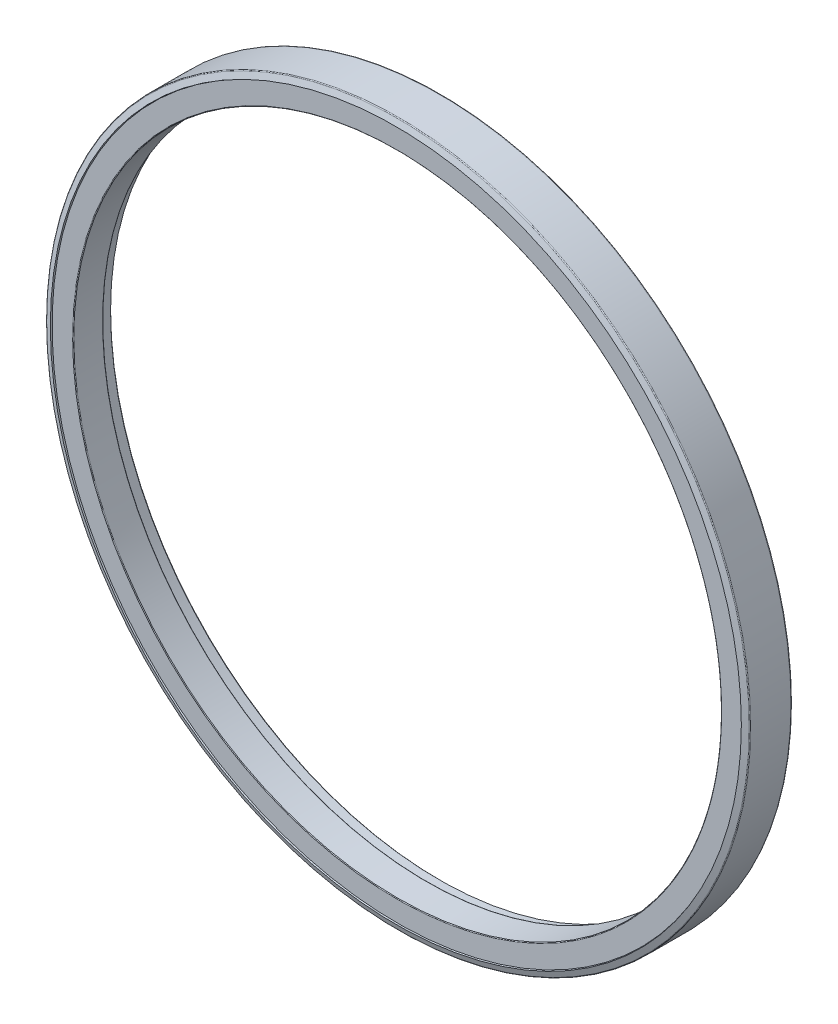
ISO-10303-21;
HEADER;
FILE_DESCRIPTION(('STEP AP214'),'2;1');
FILE_NAME('part.step','',(''),(''),'','','');
FILE_SCHEMA(('AUTOMOTIVE_DESIGN { 1 0 10303 214 1 1 1 1 }'));
ENDSEC;
DATA;
#1=APPLICATION_CONTEXT('core data for automotive mechanical design processes');
#2=APPLICATION_PROTOCOL_DEFINITION('international standard','automotive_design',2000,#1);
#3=PRODUCT_CONTEXT('',#1,'mechanical');
#4=PRODUCT('Part','Part','',(#3));
#5=PRODUCT_RELATED_PRODUCT_CATEGORY('part','',(#4));
#6=PRODUCT_DEFINITION_FORMATION('','',#4);
#7=PRODUCT_DEFINITION_CONTEXT('part definition',#1,'design');
#8=PRODUCT_DEFINITION('design','',#6,#7);
#9=PRODUCT_DEFINITION_SHAPE('','',#8);
#10=(LENGTH_UNIT() NAMED_UNIT(*) SI_UNIT(.MILLI.,.METRE.));
#11=(NAMED_UNIT(*) PLANE_ANGLE_UNIT() SI_UNIT($,.RADIAN.));
#12=(NAMED_UNIT(*) SI_UNIT($,.STERADIAN.) SOLID_ANGLE_UNIT());
#13=UNCERTAINTY_MEASURE_WITH_UNIT(LENGTH_MEASURE(1.E-05),#10,'distance_accuracy_value','');
#14=(GEOMETRIC_REPRESENTATION_CONTEXT(3) GLOBAL_UNCERTAINTY_ASSIGNED_CONTEXT((#13)) GLOBAL_UNIT_ASSIGNED_CONTEXT((#10,
#11,#12)) REPRESENTATION_CONTEXT('',''));
#15=CARTESIAN_POINT('',(0.,0.,0.));
#16=DIRECTION('',(0.,0.,1.));
#17=DIRECTION('',(1.,0.,0.));
#18=AXIS2_PLACEMENT_3D('',#15,#16,#17);
#19=CARTESIAN_POINT('',(0.,0.,-3.4163));
#20=DIRECTION('',(0.,0.,1.));
#21=DIRECTION('',(1.,0.,0.));
#22=AXIS2_PLACEMENT_3D('',#19,#20,#21);
#23=PLANE('',#22);
#24=CARTESIAN_POINT('',(0.,0.,-3.4163));
#25=DIRECTION('',(0.,0.,1.));
#26=DIRECTION('',(0.,1.,0.));
#27=AXIS2_PLACEMENT_3D('',#24,#25,#26);
#28=CIRCLE('',#27,127.254);
#29=CARTESIAN_POINT('',(0.,127.254,-3.4163));
#30=VERTEX_POINT('',#29);
#31=EDGE_CURVE('E143',#30,#30,#28,.F.);
#32=ORIENTED_EDGE('',*,*,#31,.T.);
#33=EDGE_LOOP('',(#32));
#34=FACE_BOUND('',#33,.T.);
#35=CARTESIAN_POINT('',(0.,0.,-3.4163));
#36=DIRECTION('',(0.,0.,-1.));
#37=DIRECTION('',(1.,0.,0.));
#38=AXIS2_PLACEMENT_3D('',#35,#36,#37);
#39=CIRCLE('',#38,125.6792);
#40=CARTESIAN_POINT('',(125.6792,0.,-3.4163));
#41=VERTEX_POINT('',#40);
#42=EDGE_CURVE('E174',#41,#41,#39,.T.);
#43=ORIENTED_EDGE('',*,*,#42,.F.);
#44=EDGE_LOOP('',(#43));
#45=FACE_BOUND('',#44,.T.);
#46=ADVANCED_FACE('F15',(#34,#45),#23,.F.);
#47=CARTESIAN_POINT('',(0.,0.,-3.2131));
#48=DIRECTION('',(0.,0.,1.));
#49=DIRECTION('',(1.,0.,0.));
#50=AXIS2_PLACEMENT_3D('',#47,#48,#49);
#51=TOROIDAL_SURFACE('',#50,125.6792,0.2032);
#52=CARTESIAN_POINT('',(0.,0.,-3.2131));
#53=DIRECTION('',(0.,0.,1.));
#54=DIRECTION('',(1.,0.,0.));
#55=AXIS2_PLACEMENT_3D('',#52,#53,#54);
#56=CIRCLE('',#55,125.476);
#57=CARTESIAN_POINT('',(125.476,0.,-3.2131));
#58=VERTEX_POINT('',#57);
#59=EDGE_CURVE('E138',#58,#58,#56,.T.);
#60=ORIENTED_EDGE('',*,*,#59,.T.);
#61=EDGE_LOOP('',(#60));
#62=FACE_BOUND('',#61,.T.);
#63=ORIENTED_EDGE('',*,*,#42,.T.);
#64=EDGE_LOOP('',(#63));
#65=FACE_BOUND('',#64,.T.);
#66=ADVANCED_FACE('F155',(#62,#65),#51,.T.);
#67=CARTESIAN_POINT('',(0.,0.,-3.7973));
#68=DIRECTION('',(0.,0.,1.));
#69=DIRECTION('',(1.,0.,0.));
#70=AXIS2_PLACEMENT_3D('',#67,#68,#69);
#71=TOROIDAL_SURFACE('',#70,127.254,0.381);
#72=CARTESIAN_POINT('',(0.,0.,-3.99919923967265));
#73=DIRECTION('',(0.,0.,1.));
#74=DIRECTION('',(1.,0.,0.));
#75=AXIS2_PLACEMENT_3D('',#72,#73,#74);
#76=CIRCLE('',#75,127.577106324636);
#77=CARTESIAN_POINT('',(127.577106324636,0.,-3.99919923967265));
#78=VERTEX_POINT('',#77);
#79=EDGE_CURVE('E130',#78,#78,#76,.F.);
#80=ORIENTED_EDGE('',*,*,#79,.T.);
#81=EDGE_LOOP('',(#80));
#82=FACE_BOUND('',#81,.T.);
#83=ORIENTED_EDGE('',*,*,#31,.F.);
#84=EDGE_LOOP('',(#83));
#85=FACE_BOUND('',#84,.T.);
#86=ADVANCED_FACE('F151',(#82,#85),#71,.F.);
#87=CARTESIAN_POINT('',(0.,0.,8.6233));
#88=DIRECTION('',(0.,0.,1.));
#89=DIRECTION('',(1.,0.,0.));
#90=AXIS2_PLACEMENT_3D('',#87,#88,#89);
#91=CYLINDRICAL_SURFACE('',#90,125.476);
#92=CARTESIAN_POINT('',(0.,0.,7.86129999999994));
#93=DIRECTION('',(0.,0.,-1.));
#94=DIRECTION('',(-1.,0.,0.));
#95=AXIS2_PLACEMENT_3D('',#92,#93,#94);
#96=CIRCLE('',#95,125.476);
#97=CARTESIAN_POINT('',(-125.476,0.,7.86129999999994));
#98=VERTEX_POINT('',#97);
#99=EDGE_CURVE('E111',#98,#98,#96,.T.);
#100=ORIENTED_EDGE('',*,*,#99,.F.);
#101=EDGE_LOOP('',(#100));
#102=FACE_BOUND('',#101,.T.);
#103=ORIENTED_EDGE('',*,*,#59,.F.);
#104=EDGE_LOOP('',(#103));
#105=FACE_BOUND('',#104,.T.);
#106=ADVANCED_FACE('F154',(#102,#105),#91,.F.);
#107=CARTESIAN_POINT('',(0.,0.,-3.99919923967265));
#108=DIRECTION('',(0.,0.,1.));
#109=DIRECTION('',(1.,0.,0.));
#110=AXIS2_PLACEMENT_3D('',#107,#108,#109);
#111=CONICAL_SURFACE('',#110,127.577106324636,0.558505360638183);
#112=CARTESIAN_POINT('',(0.,0.,-4.51627744753875));
#113=DIRECTION('',(0.,0.,-1.));
#114=DIRECTION('',(-1.,0.,0.));
#115=AXIS2_PLACEMENT_3D('',#112,#113,#114);
#116=CIRCLE('',#115,127.254);
#117=CARTESIAN_POINT('',(-127.254,0.,-4.51627744753875));
#118=VERTEX_POINT('',#117);
#119=EDGE_CURVE('E102',#118,#118,#116,.T.);
#120=ORIENTED_EDGE('',*,*,#119,.T.);
#121=EDGE_LOOP('',(#120));
#122=FACE_BOUND('',#121,.T.);
#123=ORIENTED_EDGE('',*,*,#79,.F.);
#124=EDGE_LOOP('',(#123));
#125=FACE_BOUND('',#124,.T.);
#126=ADVANCED_FACE('F121',(#122,#125),#111,.F.);
#127=CARTESIAN_POINT('',(0.,0.,7.86129999999994));
#128=DIRECTION('',(0.,0.,-1.));
#129=DIRECTION('',(-1.,0.,0.));
#130=AXIS2_PLACEMENT_3D('',#127,#128,#129);
#131=TOROIDAL_SURFACE('',#130,125.73,0.254);
#132=ORIENTED_EDGE('',*,*,#99,.T.);
#133=EDGE_LOOP('',(#132));
#134=FACE_BOUND('',#133,.T.);
#135=CARTESIAN_POINT('',(0.,0.,8.11529999999994));
#136=DIRECTION('',(0.,0.,1.));
#137=DIRECTION('',(-1.,0.,0.));
#138=AXIS2_PLACEMENT_3D('',#135,#136,#137);
#139=CIRCLE('',#138,125.73);
#140=CARTESIAN_POINT('',(-125.73,0.,8.11529999999994));
#141=VERTEX_POINT('',#140);
#142=EDGE_CURVE('E110',#141,#141,#139,.T.);
#143=ORIENTED_EDGE('',*,*,#142,.T.);
#144=EDGE_LOOP('',(#143));
#145=FACE_BOUND('',#144,.T.);
#146=ADVANCED_FACE('F117',(#134,#145),#131,.T.);
#147=CARTESIAN_POINT('',(0.,0.,-8.6233));
#148=DIRECTION('',(0.,0.,-1.));
#149=DIRECTION('',(-1.,0.,0.));
#150=AXIS2_PLACEMENT_3D('',#147,#148,#149);
#151=CYLINDRICAL_SURFACE('',#150,127.254);
#152=ORIENTED_EDGE('',*,*,#119,.F.);
#153=EDGE_LOOP('',(#152));
#154=FACE_BOUND('',#153,.T.);
#155=CARTESIAN_POINT('',(0.,0.,-8.11529999999999));
#156=DIRECTION('',(0.,0.,-1.));
#157=DIRECTION('',(-1.,0.,0.));
#158=AXIS2_PLACEMENT_3D('',#155,#156,#157);
#159=CIRCLE('',#158,127.254);
#160=CARTESIAN_POINT('',(-127.254,0.,-8.1153));
#161=VERTEX_POINT('',#160);
#162=EDGE_CURVE('E186',#161,#161,#159,.T.);
#163=ORIENTED_EDGE('',*,*,#162,.T.);
#164=EDGE_LOOP('',(#163));
#165=FACE_BOUND('',#164,.T.);
#166=ADVANCED_FACE('F92',(#154,#165),#151,.F.);
#167=CARTESIAN_POINT('',(0.,0.,8.11529999999994));
#168=DIRECTION('',(0.,0.,-1.));
#169=DIRECTION('',(-1.,0.,0.));
#170=AXIS2_PLACEMENT_3D('',#167,#168,#169);
#171=PLANE('',#170);
#172=CARTESIAN_POINT('',(0.,0.,8.11530000000002));
#173=DIRECTION('',(0.,0.,1.));
#174=DIRECTION('',(1.,0.,0.));
#175=AXIS2_PLACEMENT_3D('',#172,#173,#174);
#176=CIRCLE('',#175,133.673103120993);
#177=CARTESIAN_POINT('',(133.673103120993,0.,8.11530000000002));
#178=VERTEX_POINT('',#177);
#179=EDGE_CURVE('E19',#178,#178,#176,.T.);
#180=ORIENTED_EDGE('',*,*,#179,.T.);
#181=EDGE_LOOP('',(#180));
#182=FACE_BOUND('',#181,.T.);
#183=ORIENTED_EDGE('',*,*,#142,.F.);
#184=EDGE_LOOP('',(#183));
#185=FACE_BOUND('',#184,.T.);
#186=ADVANCED_FACE('F87',(#182,#185),#171,.F.);
#187=CARTESIAN_POINT('',(0.,0.,-8.6233));
#188=DIRECTION('',(0.,0.,-1.));
#189=DIRECTION('',(-1.,0.,0.));
#190=AXIS2_PLACEMENT_3D('',#187,#188,#189);
#191=CONICAL_SURFACE('',#190,127.762,0.785398163397453);
#192=CARTESIAN_POINT('',(0.,0.,-8.6233));
#193=DIRECTION('',(0.,0.,-1.));
#194=DIRECTION('',(-1.,0.,0.));
#195=AXIS2_PLACEMENT_3D('',#192,#193,#194);
#196=CIRCLE('',#195,127.762);
#197=CARTESIAN_POINT('',(-127.762,0.,-8.6233));
#198=VERTEX_POINT('',#197);
#199=EDGE_CURVE('E61',#198,#198,#196,.F.);
#200=ORIENTED_EDGE('',*,*,#199,.F.);
#201=EDGE_LOOP('',(#200));
#202=FACE_BOUND('',#201,.T.);
#203=ORIENTED_EDGE('',*,*,#162,.F.);
#204=EDGE_LOOP('',(#203));
#205=FACE_BOUND('',#204,.T.);
#206=ADVANCED_FACE('F83',(#202,#205),#191,.F.);
#207=CARTESIAN_POINT('',(0.,0.,8.62329999999999));
#208=DIRECTION('',(0.,0.,1.));
#209=DIRECTION('',(1.,0.,0.));
#210=AXIS2_PLACEMENT_3D('',#207,#208,#209);
#211=CONICAL_SURFACE('',#210,133.858,0.349065850398842);
#212=CARTESIAN_POINT('',(0.,0.,8.62330000000001));
#213=DIRECTION('',(0.,0.,-1.));
#214=DIRECTION('',(-1.,0.,0.));
#215=AXIS2_PLACEMENT_3D('',#212,#213,#214);
#216=CIRCLE('',#215,133.858);
#217=CARTESIAN_POINT('',(-133.858,0.,8.62330000000001));
#218=VERTEX_POINT('',#217);
#219=EDGE_CURVE('E57',#218,#218,#216,.T.);
#220=ORIENTED_EDGE('',*,*,#219,.F.);
#221=EDGE_LOOP('',(#220));
#222=FACE_BOUND('',#221,.T.);
#223=ORIENTED_EDGE('',*,*,#179,.F.);
#224=EDGE_LOOP('',(#223));
#225=FACE_BOUND('',#224,.T.);
#226=ADVANCED_FACE('F80',(#222,#225),#211,.F.);
#227=CARTESIAN_POINT('',(0.,0.,-8.6233));
#228=DIRECTION('',(0.,0.,-1.));
#229=DIRECTION('',(-1.,0.,0.));
#230=AXIS2_PLACEMENT_3D('',#227,#228,#229);
#231=PLANE('',#230);
#232=CARTESIAN_POINT('',(0.,0.,-8.6233));
#233=DIRECTION('',(0.,0.,1.));
#234=DIRECTION('',(-1.,0.,0.));
#235=AXIS2_PLACEMENT_3D('',#232,#233,#234);
#236=CIRCLE('',#235,135.8138);
#237=CARTESIAN_POINT('',(-135.8138,0.,-8.6233));
#238=VERTEX_POINT('',#237);
#239=EDGE_CURVE('E60',#238,#238,#236,.T.);
#240=ORIENTED_EDGE('',*,*,#239,.F.);
#241=EDGE_LOOP('',(#240));
#242=FACE_BOUND('',#241,.T.);
#243=ORIENTED_EDGE('',*,*,#199,.T.);
#244=EDGE_LOOP('',(#243));
#245=FACE_BOUND('',#244,.T.);
#246=ADVANCED_FACE('F71',(#242,#245),#231,.T.);
#247=CARTESIAN_POINT('',(0.,0.,7.8177939532765));
#248=DIRECTION('',(0.,0.,-1.));
#249=DIRECTION('',(0.,1.,0.));
#250=AXIS2_PLACEMENT_3D('',#247,#248,#249);
#251=CONICAL_SURFACE('',#250,136.071109674607,1.22173047639603);
#252=ORIENTED_EDGE('',*,*,#219,.T.);
#253=EDGE_LOOP('',(#252));
#254=FACE_BOUND('',#253,.T.);
#255=CARTESIAN_POINT('',(0.,0.,7.8177939532765));
#256=DIRECTION('',(0.,0.,-1.));
#257=DIRECTION('',(-1.,0.,0.));
#258=AXIS2_PLACEMENT_3D('',#255,#256,#257);
#259=CIRCLE('',#258,136.071109674607);
#260=CARTESIAN_POINT('',(-136.071109674607,0.,7.8177939532765));
#261=VERTEX_POINT('',#260);
#262=EDGE_CURVE('E28',#261,#261,#259,.T.);
#263=ORIENTED_EDGE('',*,*,#262,.F.);
#264=EDGE_LOOP('',(#263));
#265=FACE_BOUND('',#264,.T.);
#266=ADVANCED_FACE('F50',(#254,#265),#251,.T.);
#267=CARTESIAN_POINT('',(0.,0.,-8.1153));
#268=DIRECTION('',(0.,0.,-1.));
#269=DIRECTION('',(-1.,0.,0.));
#270=AXIS2_PLACEMENT_3D('',#267,#268,#269);
#271=TOROIDAL_SURFACE('',#270,135.8138,0.508);
#272=ORIENTED_EDGE('',*,*,#239,.T.);
#273=EDGE_LOOP('',(#272));
#274=FACE_BOUND('',#273,.T.);
#275=CARTESIAN_POINT('',(0.,0.,-8.1153));
#276=DIRECTION('',(0.,0.,1.));
#277=DIRECTION('',(1.,0.,0.));
#278=AXIS2_PLACEMENT_3D('',#275,#276,#277);
#279=CIRCLE('',#278,136.3218);
#280=CARTESIAN_POINT('',(136.3218,0.,-8.1153));
#281=VERTEX_POINT('',#280);
#282=EDGE_CURVE('E23',#281,#281,#279,.T.);
#283=ORIENTED_EDGE('',*,*,#282,.F.);
#284=EDGE_LOOP('',(#283));
#285=FACE_BOUND('',#284,.T.);
#286=ADVANCED_FACE('F44',(#274,#285),#271,.T.);
#287=CARTESIAN_POINT('',(0.,0.,7.45977106475704));
#288=DIRECTION('',(0.,0.,-1.));
#289=DIRECTION('',(-1.,0.,0.));
#290=AXIS2_PLACEMENT_3D('',#287,#288,#289);
#291=TOROIDAL_SURFACE('',#290,135.9408,0.381);
#292=ORIENTED_EDGE('',*,*,#262,.T.);
#293=EDGE_LOOP('',(#292));
#294=FACE_BOUND('',#293,.T.);
#295=CARTESIAN_POINT('',(0.,0.,7.45977106475704));
#296=DIRECTION('',(0.,0.,1.));
#297=DIRECTION('',(1.,0.,0.));
#298=AXIS2_PLACEMENT_3D('',#295,#296,#297);
#299=CIRCLE('',#298,136.3218);
#300=CARTESIAN_POINT('',(136.3218,0.,7.45977106475704));
#301=VERTEX_POINT('',#300);
#302=EDGE_CURVE('E10',#301,#301,#299,.F.);
#303=ORIENTED_EDGE('',*,*,#302,.F.);
#304=EDGE_LOOP('',(#303));
#305=FACE_BOUND('',#304,.T.);
#306=ADVANCED_FACE('F39',(#294,#305),#291,.T.);
#307=CARTESIAN_POINT('',(0.,0.,8.6233));
#308=DIRECTION('',(0.,0.,1.));
#309=DIRECTION('',(1.,0.,0.));
#310=AXIS2_PLACEMENT_3D('',#307,#308,#309);
#311=CYLINDRICAL_SURFACE('',#310,136.3218);
#312=ORIENTED_EDGE('',*,*,#302,.T.);
#313=EDGE_LOOP('',(#312));
#314=FACE_BOUND('',#313,.T.);
#315=ORIENTED_EDGE('',*,*,#282,.T.);
#316=EDGE_LOOP('',(#315));
#317=FACE_BOUND('',#316,.T.);
#318=ADVANCED_FACE('F43',(#314,#317),#311,.T.);
#319=CLOSED_SHELL('',(#46,#66,#86,#106,#126,#146,#166,#186,#206,#226,#246,#266,#286,#306,#318));
#320=MANIFOLD_SOLID_BREP('B1',#319);
#321=ADVANCED_BREP_SHAPE_REPRESENTATION('',(#18,#320),#14);
#322=SHAPE_DEFINITION_REPRESENTATION(#9,#321);
ENDSEC;
END-ISO-10303-21;
